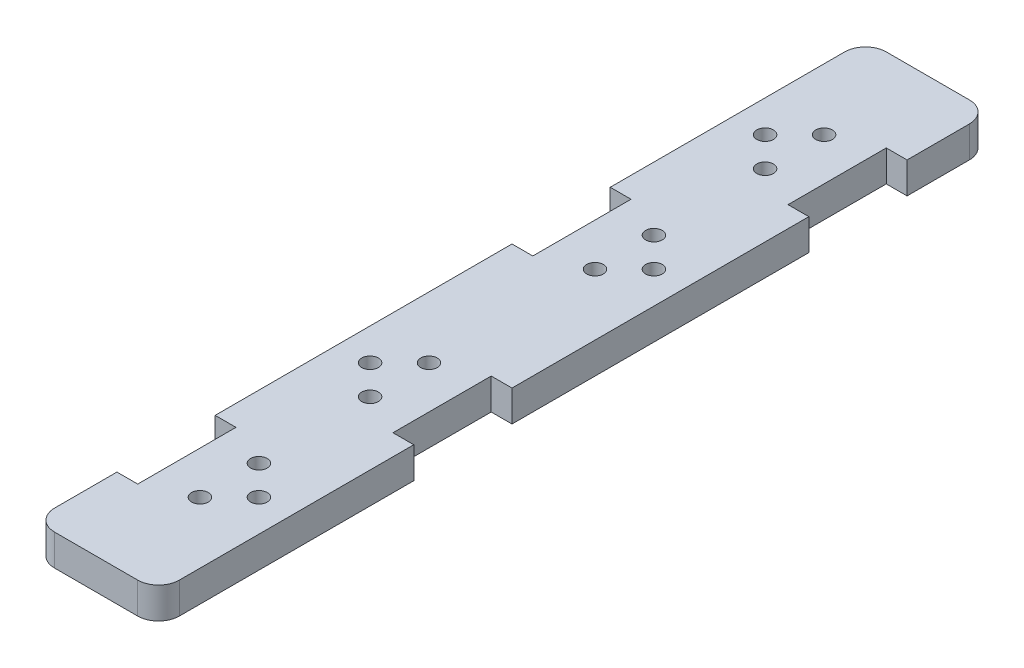
ISO-10303-21;
HEADER;
FILE_DESCRIPTION(('STEP AP214'),'2;1');
FILE_NAME('part.step','',(''),(''),'','','');
FILE_SCHEMA(('AUTOMOTIVE_DESIGN { 1 0 10303 214 1 1 1 1 }'));
ENDSEC;
DATA;
#1=APPLICATION_CONTEXT('core data for automotive mechanical design processes');
#2=APPLICATION_PROTOCOL_DEFINITION('international standard','automotive_design',2000,#1);
#3=PRODUCT_CONTEXT('',#1,'mechanical');
#4=PRODUCT('Part','Part','',(#3));
#5=PRODUCT_RELATED_PRODUCT_CATEGORY('part','',(#4));
#6=PRODUCT_DEFINITION_FORMATION('','',#4);
#7=PRODUCT_DEFINITION_CONTEXT('part definition',#1,'design');
#8=PRODUCT_DEFINITION('design','',#6,#7);
#9=PRODUCT_DEFINITION_SHAPE('','',#8);
#10=(LENGTH_UNIT() NAMED_UNIT(*) SI_UNIT(.MILLI.,.METRE.));
#11=(NAMED_UNIT(*) PLANE_ANGLE_UNIT() SI_UNIT($,.RADIAN.));
#12=(NAMED_UNIT(*) SI_UNIT($,.STERADIAN.) SOLID_ANGLE_UNIT());
#13=UNCERTAINTY_MEASURE_WITH_UNIT(LENGTH_MEASURE(1.E-05),#10,'distance_accuracy_value','');
#14=(GEOMETRIC_REPRESENTATION_CONTEXT(3) GLOBAL_UNCERTAINTY_ASSIGNED_CONTEXT((#13)) GLOBAL_UNIT_ASSIGNED_CONTEXT((#10,
#11,#12)) REPRESENTATION_CONTEXT('',''));
#15=CARTESIAN_POINT('',(0.,0.,0.));
#16=DIRECTION('',(0.,0.,1.));
#17=DIRECTION('',(1.,0.,0.));
#18=AXIS2_PLACEMENT_3D('',#15,#16,#17);
#19=CARTESIAN_POINT('',(38.1,9.525,-6.35000000000004));
#20=DIRECTION('',(-1.,0.,0.));
#21=DIRECTION('',(0.,0.,1.));
#22=AXIS2_PLACEMENT_3D('',#19,#20,#21);
#23=PLANE('',#22);
#24=DIRECTION('',(0.,0.,-1.));
#25=VECTOR('',#24,1.);
#26=CARTESIAN_POINT('',(38.1,9.525,-6.35000000000004));
#27=LINE('',#26,#25);
#28=CARTESIAN_POINT('',(38.1,9.525,-228.6));
#29=VERTEX_POINT('',#28);
#30=CARTESIAN_POINT('',(38.1,9.525,-247.65));
#31=VERTEX_POINT('',#30);
#32=EDGE_CURVE('E355',#29,#31,#27,.T.);
#33=ORIENTED_EDGE('',*,*,#32,.F.);
#34=DIRECTION('',(0.,1.,0.));
#35=VECTOR('',#34,1.);
#36=CARTESIAN_POINT('',(38.1,-0.000999999999999265,-228.6));
#37=LINE('',#36,#35);
#38=CARTESIAN_POINT('',(38.1,0.,-228.6));
#39=VERTEX_POINT('',#38);
#40=EDGE_CURVE('E304',#39,#29,#37,.T.);
#41=ORIENTED_EDGE('',*,*,#40,.F.);
#42=DIRECTION('',(0.,0.,-1.));
#43=VECTOR('',#42,1.);
#44=CARTESIAN_POINT('',(38.1,0.,-6.35000000000004));
#45=LINE('',#44,#43);
#46=CARTESIAN_POINT('',(38.1,0.,-247.65));
#47=VERTEX_POINT('',#46);
#48=EDGE_CURVE('E378',#39,#47,#45,.T.);
#49=ORIENTED_EDGE('',*,*,#48,.T.);
#50=DIRECTION('',(0.,-1.,0.));
#51=VECTOR('',#50,1.);
#52=CARTESIAN_POINT('',(38.1,9.525,-247.65));
#53=LINE('',#52,#51);
#54=EDGE_CURVE('E403',#31,#47,#53,.T.);
#55=ORIENTED_EDGE('',*,*,#54,.F.);
#56=EDGE_LOOP('',(#33,#41,#49,#55));
#57=FACE_BOUND('',#56,.T.);
#58=ADVANCED_FACE('F32',(#57),#23,.F.);
#59=CARTESIAN_POINT('',(38.1000000000013,0.,-107.95));
#60=VERTEX_POINT('',#59);
#61=CARTESIAN_POINT('',(38.1,0.,-198.6));
#62=VERTEX_POINT('',#61);
#63=EDGE_CURVE('E382',#60,#62,#45,.T.);
#64=ORIENTED_EDGE('',*,*,#63,.T.);
#65=DIRECTION('',(0.,1.,0.));
#66=VECTOR('',#65,1.);
#67=CARTESIAN_POINT('',(38.1,-0.000999999999999265,-198.6));
#68=LINE('',#67,#66);
#69=CARTESIAN_POINT('',(38.1,9.525,-198.6));
#70=VERTEX_POINT('',#69);
#71=EDGE_CURVE('E306',#62,#70,#68,.T.);
#72=ORIENTED_EDGE('',*,*,#71,.T.);
#73=CARTESIAN_POINT('',(38.1000000000013,9.525,-107.95));
#74=VERTEX_POINT('',#73);
#75=EDGE_CURVE('E360',#74,#70,#27,.T.);
#76=ORIENTED_EDGE('',*,*,#75,.F.);
#77=DIRECTION('',(0.,1.,0.));
#78=VECTOR('',#77,1.);
#79=CARTESIAN_POINT('',(38.1000000000013,-0.000999999999999265,-107.95));
#80=LINE('',#79,#78);
#81=EDGE_CURVE('E235',#60,#74,#80,.T.);
#82=ORIENTED_EDGE('',*,*,#81,.F.);
#83=EDGE_LOOP('',(#64,#72,#76,#82));
#84=FACE_BOUND('',#83,.T.);
#85=ADVANCED_FACE('F465',(#84),#23,.F.);
#86=CARTESIAN_POINT('',(0.,9.525,-6.35000000000004));
#87=DIRECTION('',(1.,0.,0.));
#88=DIRECTION('',(0.,0.,-1.));
#89=AXIS2_PLACEMENT_3D('',#86,#87,#88);
#90=PLANE('',#89);
#91=DIRECTION('',(0.,0.,1.));
#92=VECTOR('',#91,1.);
#93=CARTESIAN_POINT('',(0.,0.,-6.35000000000004));
#94=LINE('',#93,#92);
#95=CARTESIAN_POINT('',(0.,0.,-247.65));
#96=VERTEX_POINT('',#95);
#97=CARTESIAN_POINT('',(-3.6920551925212E-13,0.,-176.05));
#98=VERTEX_POINT('',#97);
#99=EDGE_CURVE('E351',#96,#98,#94,.T.);
#100=ORIENTED_EDGE('',*,*,#99,.T.);
#101=DIRECTION('',(0.,1.,0.));
#102=VECTOR('',#101,1.);
#103=CARTESIAN_POINT('',(-3.6920551925212E-13,-0.000999999999999265,-176.05));
#104=LINE('',#103,#102);
#105=CARTESIAN_POINT('',(-3.6920551925212E-13,9.525,-176.05));
#106=VERTEX_POINT('',#105);
#107=EDGE_CURVE('E266',#98,#106,#104,.T.);
#108=ORIENTED_EDGE('',*,*,#107,.T.);
#109=DIRECTION('',(0.,0.,1.));
#110=VECTOR('',#109,1.);
#111=CARTESIAN_POINT('',(0.,9.525,-6.35000000000004));
#112=LINE('',#111,#110);
#113=CARTESIAN_POINT('',(0.,9.525,-247.65));
#114=VERTEX_POINT('',#113);
#115=EDGE_CURVE('E367',#114,#106,#112,.T.);
#116=ORIENTED_EDGE('',*,*,#115,.F.);
#117=DIRECTION('',(0.,-1.,0.));
#118=VECTOR('',#117,1.);
#119=CARTESIAN_POINT('',(0.,9.525,-247.65));
#120=LINE('',#119,#118);
#121=EDGE_CURVE('E394',#114,#96,#120,.T.);
#122=ORIENTED_EDGE('',*,*,#121,.T.);
#123=EDGE_LOOP('',(#100,#108,#116,#122));
#124=FACE_BOUND('',#123,.T.);
#125=ADVANCED_FACE('F454',(#124),#90,.F.);
#126=CARTESIAN_POINT('',(-3.67037114907149E-13,9.525,-146.05));
#127=VERTEX_POINT('',#126);
#128=CARTESIAN_POINT('',(0.,9.525,-55.4));
#129=VERTEX_POINT('',#128);
#130=EDGE_CURVE('E371',#127,#129,#112,.T.);
#131=ORIENTED_EDGE('',*,*,#130,.F.);
#132=DIRECTION('',(0.,1.,0.));
#133=VECTOR('',#132,1.);
#134=CARTESIAN_POINT('',(-3.67037114907149E-13,-0.000999999999999265,-146.05));
#135=LINE('',#134,#133);
#136=CARTESIAN_POINT('',(0.,0.,-146.05));
#137=VERTEX_POINT('',#136);
#138=EDGE_CURVE('E265',#137,#127,#135,.T.);
#139=ORIENTED_EDGE('',*,*,#138,.F.);
#140=CARTESIAN_POINT('',(0.,0.,-55.4));
#141=VERTEX_POINT('',#140);
#142=EDGE_CURVE('E391',#137,#141,#94,.T.);
#143=ORIENTED_EDGE('',*,*,#142,.T.);
#144=DIRECTION('',(0.,1.,0.));
#145=VECTOR('',#144,1.);
#146=CARTESIAN_POINT('',(0.,-0.000999999999999265,-55.4));
#147=LINE('',#146,#145);
#148=EDGE_CURVE('E336',#141,#129,#147,.T.);
#149=ORIENTED_EDGE('',*,*,#148,.T.);
#150=EDGE_LOOP('',(#131,#139,#143,#149));
#151=FACE_BOUND('',#150,.T.);
#152=ADVANCED_FACE('F438',(#151),#90,.F.);
#153=CARTESIAN_POINT('',(6.35,9.525,-6.35));
#154=DIRECTION('',(0.,-1.,0.));
#155=DIRECTION('',(0.,0.,-1.));
#156=AXIS2_PLACEMENT_3D('',#153,#154,#155);
#157=CYLINDRICAL_SURFACE('',#156,6.35);
#158=CARTESIAN_POINT('',(6.35,0.,-6.35));
#159=DIRECTION('',(0.,1.,0.));
#160=DIRECTION('',(0.,0.,1.));
#161=AXIS2_PLACEMENT_3D('',#158,#159,#160);
#162=CIRCLE('',#161,6.35);
#163=CARTESIAN_POINT('',(0.,0.,-6.35000000000004));
#164=VERTEX_POINT('',#163);
#165=CARTESIAN_POINT('',(6.35000000000004,0.,0.));
#166=VERTEX_POINT('',#165);
#167=EDGE_CURVE('E346',#164,#166,#162,.T.);
#168=ORIENTED_EDGE('',*,*,#167,.T.);
#169=DIRECTION('',(0.,-1.,0.));
#170=VECTOR('',#169,1.);
#171=CARTESIAN_POINT('',(6.35000000000004,9.525,0.));
#172=LINE('',#171,#170);
#173=CARTESIAN_POINT('',(6.35000000000004,9.525,0.));
#174=VERTEX_POINT('',#173);
#175=EDGE_CURVE('E11',#174,#166,#172,.T.);
#176=ORIENTED_EDGE('',*,*,#175,.F.);
#177=CARTESIAN_POINT('',(6.35,9.525,-6.35));
#178=DIRECTION('',(0.,1.,0.));
#179=DIRECTION('',(0.,0.,1.));
#180=AXIS2_PLACEMENT_3D('',#177,#178,#179);
#181=CIRCLE('',#180,6.35);
#182=CARTESIAN_POINT('',(0.,9.525,-6.35000000000004));
#183=VERTEX_POINT('',#182);
#184=EDGE_CURVE('E347',#183,#174,#181,.T.);
#185=ORIENTED_EDGE('',*,*,#184,.F.);
#186=DIRECTION('',(0.,-1.,0.));
#187=VECTOR('',#186,1.);
#188=CARTESIAN_POINT('',(0.,9.525,-6.35000000000004));
#189=LINE('',#188,#187);
#190=EDGE_CURVE('E370',#183,#164,#189,.T.);
#191=ORIENTED_EDGE('',*,*,#190,.T.);
#192=EDGE_LOOP('',(#168,#176,#185,#191));
#193=FACE_BOUND('',#192,.T.);
#194=ADVANCED_FACE('F34',(#193),#157,.T.);
#195=CARTESIAN_POINT('',(6.35000000000004,9.525,0.));
#196=DIRECTION('',(0.,0.,-1.));
#197=DIRECTION('',(-1.,0.,0.));
#198=AXIS2_PLACEMENT_3D('',#195,#196,#197);
#199=PLANE('',#198);
#200=DIRECTION('',(1.,0.,0.));
#201=VECTOR('',#200,1.);
#202=CARTESIAN_POINT('',(6.35000000000004,0.,0.));
#203=LINE('',#202,#201);
#204=CARTESIAN_POINT('',(31.75,0.,0.));
#205=VERTEX_POINT('',#204);
#206=EDGE_CURVE('E374',#166,#205,#203,.T.);
#207=ORIENTED_EDGE('',*,*,#206,.T.);
#208=DIRECTION('',(0.,-1.,0.));
#209=VECTOR('',#208,1.);
#210=CARTESIAN_POINT('',(31.75,9.525,0.));
#211=LINE('',#210,#209);
#212=CARTESIAN_POINT('',(31.75,9.525,0.));
#213=VERTEX_POINT('',#212);
#214=EDGE_CURVE('E40',#213,#205,#211,.T.);
#215=ORIENTED_EDGE('',*,*,#214,.F.);
#216=DIRECTION('',(1.,0.,0.));
#217=VECTOR('',#216,1.);
#218=CARTESIAN_POINT('',(6.35000000000004,9.525,0.));
#219=LINE('',#218,#217);
#220=EDGE_CURVE('E350',#174,#213,#219,.T.);
#221=ORIENTED_EDGE('',*,*,#220,.F.);
#222=ORIENTED_EDGE('',*,*,#175,.T.);
#223=EDGE_LOOP('',(#207,#215,#221,#222));
#224=FACE_BOUND('',#223,.T.);
#225=ADVANCED_FACE('F426',(#224),#199,.F.);
#226=CARTESIAN_POINT('',(31.75,9.525,-6.35));
#227=DIRECTION('',(0.,-1.,0.));
#228=DIRECTION('',(0.,0.,-1.));
#229=AXIS2_PLACEMENT_3D('',#226,#227,#228);
#230=CYLINDRICAL_SURFACE('',#229,6.35);
#231=CARTESIAN_POINT('',(31.75,0.,-6.35));
#232=DIRECTION('',(0.,1.,0.));
#233=DIRECTION('',(0.,0.,1.));
#234=AXIS2_PLACEMENT_3D('',#231,#232,#233);
#235=CIRCLE('',#234,6.35);
#236=CARTESIAN_POINT('',(38.1,0.,-6.35000000000004));
#237=VERTEX_POINT('',#236);
#238=EDGE_CURVE('E376',#205,#237,#235,.T.);
#239=ORIENTED_EDGE('',*,*,#238,.T.);
#240=DIRECTION('',(0.,-1.,0.));
#241=VECTOR('',#240,1.);
#242=CARTESIAN_POINT('',(38.1,9.525,-6.35000000000004));
#243=LINE('',#242,#241);
#244=CARTESIAN_POINT('',(38.1,9.525,-6.35000000000004));
#245=VERTEX_POINT('',#244);
#246=EDGE_CURVE('E406',#245,#237,#243,.T.);
#247=ORIENTED_EDGE('',*,*,#246,.F.);
#248=CARTESIAN_POINT('',(31.75,9.525,-6.35));
#249=DIRECTION('',(0.,1.,0.));
#250=DIRECTION('',(0.,0.,1.));
#251=AXIS2_PLACEMENT_3D('',#248,#249,#250);
#252=CIRCLE('',#251,6.35);
#253=EDGE_CURVE('E353',#213,#245,#252,.T.);
#254=ORIENTED_EDGE('',*,*,#253,.F.);
#255=ORIENTED_EDGE('',*,*,#214,.T.);
#256=EDGE_LOOP('',(#239,#247,#254,#255));
#257=FACE_BOUND('',#256,.T.);
#258=ADVANCED_FACE('F413',(#257),#230,.T.);
#259=CARTESIAN_POINT('',(38.1,0.,-77.95));
#260=VERTEX_POINT('',#259);
#261=EDGE_CURVE('E379',#237,#260,#45,.T.);
#262=ORIENTED_EDGE('',*,*,#261,.T.);
#263=DIRECTION('',(0.,1.,0.));
#264=VECTOR('',#263,1.);
#265=CARTESIAN_POINT('',(38.1000000000013,-0.000999999999999265,-77.9500000000001));
#266=LINE('',#265,#264);
#267=CARTESIAN_POINT('',(38.1000000000013,9.525,-77.9500000000001));
#268=VERTEX_POINT('',#267);
#269=EDGE_CURVE('E203',#260,#268,#266,.T.);
#270=ORIENTED_EDGE('',*,*,#269,.T.);
#271=EDGE_CURVE('E356',#245,#268,#27,.T.);
#272=ORIENTED_EDGE('',*,*,#271,.F.);
#273=ORIENTED_EDGE('',*,*,#246,.T.);
#274=EDGE_LOOP('',(#262,#270,#272,#273));
#275=FACE_BOUND('',#274,.T.);
#276=ADVANCED_FACE('F418',(#275),#23,.F.);
#277=CARTESIAN_POINT('',(31.75,9.525,-247.65));
#278=DIRECTION('',(0.,-1.,0.));
#279=DIRECTION('',(0.,0.,-1.));
#280=AXIS2_PLACEMENT_3D('',#277,#278,#279);
#281=CYLINDRICAL_SURFACE('',#280,6.35);
#282=CARTESIAN_POINT('',(31.75,0.,-247.65));
#283=DIRECTION('',(0.,1.,0.));
#284=DIRECTION('',(0.,0.,1.));
#285=AXIS2_PLACEMENT_3D('',#282,#283,#284);
#286=CIRCLE('',#285,6.35);
#287=CARTESIAN_POINT('',(31.75,0.,-254.));
#288=VERTEX_POINT('',#287);
#289=EDGE_CURVE('E381',#47,#288,#286,.T.);
#290=ORIENTED_EDGE('',*,*,#289,.T.);
#291=DIRECTION('',(0.,-1.,0.));
#292=VECTOR('',#291,1.);
#293=CARTESIAN_POINT('',(31.75,9.525,-254.));
#294=LINE('',#293,#292);
#295=CARTESIAN_POINT('',(31.75,9.525,-254.));
#296=VERTEX_POINT('',#295);
#297=EDGE_CURVE('E400',#296,#288,#294,.T.);
#298=ORIENTED_EDGE('',*,*,#297,.F.);
#299=CARTESIAN_POINT('',(31.75,9.525,-247.65));
#300=DIRECTION('',(0.,1.,0.));
#301=DIRECTION('',(0.,0.,1.));
#302=AXIS2_PLACEMENT_3D('',#299,#300,#301);
#303=CIRCLE('',#302,6.35);
#304=EDGE_CURVE('E359',#31,#296,#303,.T.);
#305=ORIENTED_EDGE('',*,*,#304,.F.);
#306=ORIENTED_EDGE('',*,*,#54,.T.);
#307=EDGE_LOOP('',(#290,#298,#305,#306));
#308=FACE_BOUND('',#307,.T.);
#309=ADVANCED_FACE('F479',(#308),#281,.T.);
#310=CARTESIAN_POINT('',(6.35000000000004,9.525,-254.));
#311=DIRECTION('',(0.,0.,1.));
#312=DIRECTION('',(1.,0.,0.));
#313=AXIS2_PLACEMENT_3D('',#310,#311,#312);
#314=PLANE('',#313);
#315=DIRECTION('',(-1.,0.,0.));
#316=VECTOR('',#315,1.);
#317=CARTESIAN_POINT('',(6.35000000000004,0.,-254.));
#318=LINE('',#317,#316);
#319=CARTESIAN_POINT('',(6.35000000000004,0.,-254.));
#320=VERTEX_POINT('',#319);
#321=EDGE_CURVE('E384',#288,#320,#318,.T.);
#322=ORIENTED_EDGE('',*,*,#321,.T.);
#323=DIRECTION('',(0.,-1.,0.));
#324=VECTOR('',#323,1.);
#325=CARTESIAN_POINT('',(6.35000000000004,9.525,-254.));
#326=LINE('',#325,#324);
#327=CARTESIAN_POINT('',(6.35000000000004,9.525,-254.));
#328=VERTEX_POINT('',#327);
#329=EDGE_CURVE('E397',#328,#320,#326,.T.);
#330=ORIENTED_EDGE('',*,*,#329,.F.);
#331=DIRECTION('',(-1.,0.,0.));
#332=VECTOR('',#331,1.);
#333=CARTESIAN_POINT('',(6.35000000000004,9.525,-254.));
#334=LINE('',#333,#332);
#335=EDGE_CURVE('E362',#296,#328,#334,.T.);
#336=ORIENTED_EDGE('',*,*,#335,.F.);
#337=ORIENTED_EDGE('',*,*,#297,.T.);
#338=EDGE_LOOP('',(#322,#330,#336,#337));
#339=FACE_BOUND('',#338,.T.);
#340=ADVANCED_FACE('F460',(#339),#314,.F.);
#341=CARTESIAN_POINT('',(6.35,9.525,-247.65));
#342=DIRECTION('',(0.,-1.,0.));
#343=DIRECTION('',(0.,0.,-1.));
#344=AXIS2_PLACEMENT_3D('',#341,#342,#343);
#345=CYLINDRICAL_SURFACE('',#344,6.35);
#346=CARTESIAN_POINT('',(6.35,0.,-247.65));
#347=DIRECTION('',(0.,1.,0.));
#348=DIRECTION('',(0.,0.,1.));
#349=AXIS2_PLACEMENT_3D('',#346,#347,#348);
#350=CIRCLE('',#349,6.35);
#351=EDGE_CURVE('E386',#320,#96,#350,.T.);
#352=ORIENTED_EDGE('',*,*,#351,.T.);
#353=ORIENTED_EDGE('',*,*,#121,.F.);
#354=CARTESIAN_POINT('',(6.35,9.525,-247.65));
#355=DIRECTION('',(0.,1.,0.));
#356=DIRECTION('',(0.,0.,1.));
#357=AXIS2_PLACEMENT_3D('',#354,#355,#356);
#358=CIRCLE('',#357,6.35);
#359=EDGE_CURVE('E364',#328,#114,#358,.T.);
#360=ORIENTED_EDGE('',*,*,#359,.F.);
#361=ORIENTED_EDGE('',*,*,#329,.T.);
#362=EDGE_LOOP('',(#352,#353,#360,#361));
#363=FACE_BOUND('',#362,.T.);
#364=ADVANCED_FACE('F452',(#363),#345,.T.);
#365=CARTESIAN_POINT('',(0.,9.525,-25.4));
#366=VERTEX_POINT('',#365);
#367=EDGE_CURVE('E366',#366,#183,#112,.T.);
#368=ORIENTED_EDGE('',*,*,#367,.F.);
#369=DIRECTION('',(0.,1.,0.));
#370=VECTOR('',#369,1.);
#371=CARTESIAN_POINT('',(0.,-0.000999999999999265,-25.4));
#372=LINE('',#371,#370);
#373=CARTESIAN_POINT('',(0.,0.,-25.4));
#374=VERTEX_POINT('',#373);
#375=EDGE_CURVE('E335',#374,#366,#372,.T.);
#376=ORIENTED_EDGE('',*,*,#375,.F.);
#377=EDGE_CURVE('E388',#374,#164,#94,.T.);
#378=ORIENTED_EDGE('',*,*,#377,.T.);
#379=ORIENTED_EDGE('',*,*,#190,.F.);
#380=EDGE_LOOP('',(#368,#376,#378,#379));
#381=FACE_BOUND('',#380,.T.);
#382=ADVANCED_FACE('F450',(#381),#90,.F.);
#383=CARTESIAN_POINT('',(6.35,9.525,-6.35));
#384=DIRECTION('',(0.,1.,0.));
#385=DIRECTION('',(0.,0.,1.));
#386=AXIS2_PLACEMENT_3D('',#383,#384,#385);
#387=PLANE('',#386);
#388=DIRECTION('',(-1.,0.,0.));
#389=VECTOR('',#388,1.);
#390=CARTESIAN_POINT('',(-3.6920551925212E-13,9.525,-176.05));
#391=LINE('',#390,#389);
#392=CARTESIAN_POINT('',(6.34999999999963,9.525,-176.05));
#393=VERTEX_POINT('',#392);
#394=EDGE_CURVE('E263',#393,#106,#391,.T.);
#395=ORIENTED_EDGE('',*,*,#394,.F.);
#396=DIRECTION('',(0.,0.,-1.));
#397=VECTOR('',#396,1.);
#398=CARTESIAN_POINT('',(6.34999999999963,9.525,-176.05));
#399=LINE('',#398,#397);
#400=CARTESIAN_POINT('',(6.34999999999963,9.525,-146.05));
#401=VERTEX_POINT('',#400);
#402=EDGE_CURVE('E260',#401,#393,#399,.T.);
#403=ORIENTED_EDGE('',*,*,#402,.F.);
#404=DIRECTION('',(1.,0.,0.));
#405=VECTOR('',#404,1.);
#406=CARTESIAN_POINT('',(-3.67037114907149E-13,9.525,-146.05));
#407=LINE('',#406,#405);
#408=EDGE_CURVE('E257',#127,#401,#407,.T.);
#409=ORIENTED_EDGE('',*,*,#408,.F.);
#410=ORIENTED_EDGE('',*,*,#130,.T.);
#411=DIRECTION('',(-1.,0.,0.));
#412=VECTOR('',#411,1.);
#413=CARTESIAN_POINT('',(0.,9.525,-55.4));
#414=LINE('',#413,#412);
#415=CARTESIAN_POINT('',(6.35000000000005,9.525,-55.4));
#416=VERTEX_POINT('',#415);
#417=EDGE_CURVE('E333',#416,#129,#414,.T.);
#418=ORIENTED_EDGE('',*,*,#417,.F.);
#419=DIRECTION('',(0.,0.,-1.));
#420=VECTOR('',#419,1.);
#421=CARTESIAN_POINT('',(6.35000000000005,9.525,-55.4));
#422=LINE('',#421,#420);
#423=CARTESIAN_POINT('',(6.35000000000005,9.525,-25.4));
#424=VERTEX_POINT('',#423);
#425=EDGE_CURVE('E330',#424,#416,#422,.T.);
#426=ORIENTED_EDGE('',*,*,#425,.F.);
#427=DIRECTION('',(1.,0.,0.));
#428=VECTOR('',#427,1.);
#429=CARTESIAN_POINT('',(0.,9.525,-25.4));
#430=LINE('',#429,#428);
#431=EDGE_CURVE('E327',#366,#424,#430,.T.);
#432=ORIENTED_EDGE('',*,*,#431,.F.);
#433=ORIENTED_EDGE('',*,*,#367,.T.);
#434=ORIENTED_EDGE('',*,*,#184,.T.);
#435=ORIENTED_EDGE('',*,*,#220,.T.);
#436=ORIENTED_EDGE('',*,*,#253,.T.);
#437=ORIENTED_EDGE('',*,*,#271,.T.);
#438=DIRECTION('',(1.,0.,0.));
#439=VECTOR('',#438,1.);
#440=CARTESIAN_POINT('',(31.7500000000013,9.525,-77.95));
#441=LINE('',#440,#439);
#442=CARTESIAN_POINT('',(31.7500000000013,9.525,-77.95));
#443=VERTEX_POINT('',#442);
#444=EDGE_CURVE('E230',#443,#268,#441,.T.);
#445=ORIENTED_EDGE('',*,*,#444,.F.);
#446=DIRECTION('',(0.,0.,1.));
#447=VECTOR('',#446,1.);
#448=CARTESIAN_POINT('',(31.7500000000013,9.525,-107.95));
#449=LINE('',#448,#447);
#450=CARTESIAN_POINT('',(31.7500000000013,9.525,-107.95));
#451=VERTEX_POINT('',#450);
#452=EDGE_CURVE('E200',#451,#443,#449,.T.);
#453=ORIENTED_EDGE('',*,*,#452,.F.);
#454=DIRECTION('',(-1.,0.,0.));
#455=VECTOR('',#454,1.);
#456=CARTESIAN_POINT('',(31.7500000000013,9.525,-107.95));
#457=LINE('',#456,#455);
#458=EDGE_CURVE('E204',#74,#451,#457,.T.);
#459=ORIENTED_EDGE('',*,*,#458,.F.);
#460=ORIENTED_EDGE('',*,*,#75,.T.);
#461=DIRECTION('',(1.,0.,0.));
#462=VECTOR('',#461,1.);
#463=CARTESIAN_POINT('',(31.75,9.525,-198.6));
#464=LINE('',#463,#462);
#465=CARTESIAN_POINT('',(31.75,9.525,-198.6));
#466=VERTEX_POINT('',#465);
#467=EDGE_CURVE('E296',#466,#70,#464,.T.);
#468=ORIENTED_EDGE('',*,*,#467,.F.);
#469=DIRECTION('',(0.,0.,1.));
#470=VECTOR('',#469,1.);
#471=CARTESIAN_POINT('',(31.75,9.525,-228.6));
#472=LINE('',#471,#470);
#473=CARTESIAN_POINT('',(31.75,9.525,-228.6));
#474=VERTEX_POINT('',#473);
#475=EDGE_CURVE('E293',#474,#466,#472,.T.);
#476=ORIENTED_EDGE('',*,*,#475,.F.);
#477=DIRECTION('',(-1.,0.,0.));
#478=VECTOR('',#477,1.);
#479=CARTESIAN_POINT('',(31.75,9.525,-228.6));
#480=LINE('',#479,#478);
#481=EDGE_CURVE('E298',#29,#474,#480,.T.);
#482=ORIENTED_EDGE('',*,*,#481,.F.);
#483=ORIENTED_EDGE('',*,*,#32,.T.);
#484=ORIENTED_EDGE('',*,*,#304,.T.);
#485=ORIENTED_EDGE('',*,*,#335,.T.);
#486=ORIENTED_EDGE('',*,*,#359,.T.);
#487=ORIENTED_EDGE('',*,*,#115,.T.);
#488=EDGE_LOOP('',(#395,#403,#409,#410,#418,#426,#432,#433,#434,#435,#436,#437,#445,#453,#459,
#460,#468,#476,#482,#483,#484,#485,#486,#487));
#489=FACE_BOUND('',#488,.T.);
#490=CARTESIAN_POINT('',(28.3499991799996,9.525,-161.05));
#491=DIRECTION('',(0.,1.,0.));
#492=DIRECTION('',(0.,0.,1.));
#493=AXIS2_PLACEMENT_3D('',#490,#491,#492);
#494=CIRCLE('',#493,2.54);
#495=CARTESIAN_POINT('',(28.3499991799996,9.525,-158.51));
#496=VERTEX_POINT('',#495);
#497=EDGE_CURVE('E245',#496,#496,#494,.T.);
#498=ORIENTED_EDGE('',*,*,#497,.F.);
#499=EDGE_LOOP('',(#498));
#500=FACE_BOUND('',#499,.T.);
#501=CARTESIAN_POINT('',(19.3499993999996,9.525,-170.04999978));
#502=DIRECTION('',(0.,1.,0.));
#503=DIRECTION('',(0.,0.,1.));
#504=AXIS2_PLACEMENT_3D('',#501,#502,#503);
#505=CIRCLE('',#504,2.54);
#506=CARTESIAN_POINT('',(19.3499993999996,9.525,-167.50999978));
#507=VERTEX_POINT('',#506);
#508=EDGE_CURVE('E238',#507,#507,#505,.T.);
#509=ORIENTED_EDGE('',*,*,#508,.F.);
#510=EDGE_LOOP('',(#509));
#511=FACE_BOUND('',#510,.T.);
#512=CARTESIAN_POINT('',(19.3499993999996,9.525,-152.05000022));
#513=DIRECTION('',(0.,1.,0.));
#514=DIRECTION('',(0.,0.,-1.));
#515=AXIS2_PLACEMENT_3D('',#512,#513,#514);
#516=CIRCLE('',#515,2.54);
#517=CARTESIAN_POINT('',(19.3499993999996,9.525,-154.59000022));
#518=VERTEX_POINT('',#517);
#519=EDGE_CURVE('E246',#518,#518,#516,.T.);
#520=ORIENTED_EDGE('',*,*,#519,.F.);
#521=EDGE_LOOP('',(#520));
#522=FACE_BOUND('',#521,.T.);
#523=CARTESIAN_POINT('',(28.3499991800001,9.525,-40.4));
#524=DIRECTION('',(0.,1.,0.));
#525=DIRECTION('',(0.,0.,1.));
#526=AXIS2_PLACEMENT_3D('',#523,#524,#525);
#527=CIRCLE('',#526,2.54);
#528=CARTESIAN_POINT('',(28.3499991800001,9.525,-37.86));
#529=VERTEX_POINT('',#528);
#530=EDGE_CURVE('E312',#529,#529,#527,.T.);
#531=ORIENTED_EDGE('',*,*,#530,.F.);
#532=EDGE_LOOP('',(#531));
#533=FACE_BOUND('',#532,.T.);
#534=CARTESIAN_POINT('',(19.3499994,9.525,-49.39999978));
#535=DIRECTION('',(0.,1.,0.));
#536=DIRECTION('',(0.,0.,1.));
#537=AXIS2_PLACEMENT_3D('',#534,#535,#536);
#538=CIRCLE('',#537,2.54);
#539=CARTESIAN_POINT('',(19.3499994,9.525,-46.85999978));
#540=VERTEX_POINT('',#539);
#541=EDGE_CURVE('E288',#540,#540,#538,.T.);
#542=ORIENTED_EDGE('',*,*,#541,.F.);
#543=EDGE_LOOP('',(#542));
#544=FACE_BOUND('',#543,.T.);
#545=CARTESIAN_POINT('',(19.3499994,9.525,-31.40000022));
#546=DIRECTION('',(0.,1.,0.));
#547=DIRECTION('',(0.,0.,-1.));
#548=AXIS2_PLACEMENT_3D('',#545,#546,#547);
#549=CIRCLE('',#548,2.54);
#550=CARTESIAN_POINT('',(19.3499994,9.525,-33.94000022));
#551=VERTEX_POINT('',#550);
#552=EDGE_CURVE('E281',#551,#551,#549,.T.);
#553=ORIENTED_EDGE('',*,*,#552,.F.);
#554=EDGE_LOOP('',(#553));
#555=FACE_BOUND('',#554,.T.);
#556=CARTESIAN_POINT('',(18.7500006000013,9.525,-83.95000022));
#557=DIRECTION('',(0.,1.,0.));
#558=DIRECTION('',(0.,0.,-1.));
#559=AXIS2_PLACEMENT_3D('',#556,#557,#558);
#560=CIRCLE('',#559,2.54000000000001);
#561=CARTESIAN_POINT('',(18.7500006000013,9.525,-86.49000022));
#562=VERTEX_POINT('',#561);
#563=EDGE_CURVE('E878',#562,#562,#560,.T.);
#564=ORIENTED_EDGE('',*,*,#563,.F.);
#565=EDGE_LOOP('',(#564));
#566=FACE_BOUND('',#565,.T.);
#567=CARTESIAN_POINT('',(18.7500006000013,9.525,-101.94999978));
#568=DIRECTION('',(0.,1.,0.));
#569=DIRECTION('',(0.,0.,1.));
#570=AXIS2_PLACEMENT_3D('',#567,#568,#569);
#571=CIRCLE('',#570,2.54000000000001);
#572=CARTESIAN_POINT('',(18.7500006000013,9.525,-99.40999978));
#573=VERTEX_POINT('',#572);
#574=EDGE_CURVE('E877',#573,#573,#571,.T.);
#575=ORIENTED_EDGE('',*,*,#574,.F.);
#576=EDGE_LOOP('',(#575));
#577=FACE_BOUND('',#576,.T.);
#578=CARTESIAN_POINT('',(9.75000082000127,9.525,-92.95));
#579=DIRECTION('',(0.,1.,0.));
#580=DIRECTION('',(0.,0.,1.));
#581=AXIS2_PLACEMENT_3D('',#578,#579,#580);
#582=CIRCLE('',#581,2.54);
#583=CARTESIAN_POINT('',(9.75000082000127,9.525,-90.41));
#584=VERTEX_POINT('',#583);
#585=EDGE_CURVE('E223',#584,#584,#582,.T.);
#586=ORIENTED_EDGE('',*,*,#585,.F.);
#587=EDGE_LOOP('',(#586));
#588=FACE_BOUND('',#587,.T.);
#589=CARTESIAN_POINT('',(18.7500006,9.525,-204.60000022));
#590=DIRECTION('',(0.,1.,0.));
#591=DIRECTION('',(0.,0.,-1.));
#592=AXIS2_PLACEMENT_3D('',#589,#590,#591);
#593=CIRCLE('',#592,2.54000000000001);
#594=CARTESIAN_POINT('',(18.7500006,9.525,-207.14000022));
#595=VERTEX_POINT('',#594);
#596=EDGE_CURVE('E213',#595,#595,#593,.T.);
#597=ORIENTED_EDGE('',*,*,#596,.F.);
#598=EDGE_LOOP('',(#597));
#599=FACE_BOUND('',#598,.T.);
#600=CARTESIAN_POINT('',(18.7500006,9.525,-222.59999978));
#601=DIRECTION('',(0.,1.,0.));
#602=DIRECTION('',(0.,0.,1.));
#603=AXIS2_PLACEMENT_3D('',#600,#601,#602);
#604=CIRCLE('',#603,2.54000000000001);
#605=CARTESIAN_POINT('',(18.7500006,9.525,-220.05999978));
#606=VERTEX_POINT('',#605);
#607=EDGE_CURVE('E864',#606,#606,#604,.T.);
#608=ORIENTED_EDGE('',*,*,#607,.F.);
#609=EDGE_LOOP('',(#608));
#610=FACE_BOUND('',#609,.T.);
#611=CARTESIAN_POINT('',(9.75000082000001,9.525,-213.6));
#612=DIRECTION('',(0.,1.,0.));
#613=DIRECTION('',(0.,0.,1.));
#614=AXIS2_PLACEMENT_3D('',#611,#612,#613);
#615=CIRCLE('',#614,2.54);
#616=CARTESIAN_POINT('',(9.75000082000001,9.525,-211.06));
#617=VERTEX_POINT('',#616);
#618=EDGE_CURVE('E858',#617,#617,#615,.T.);
#619=ORIENTED_EDGE('',*,*,#618,.F.);
#620=EDGE_LOOP('',(#619));
#621=FACE_BOUND('',#620,.T.);
#622=ADVANCED_FACE('F422',(#489,#500,#511,#522,#533,#544,#555,#566,#577,#588,#599,#610,#621),
#387,.T.);
#623=CARTESIAN_POINT('',(6.35,0.,-6.35));
#624=DIRECTION('',(0.,1.,0.));
#625=DIRECTION('',(0.,0.,1.));
#626=AXIS2_PLACEMENT_3D('',#623,#624,#625);
#627=PLANE('',#626);
#628=CARTESIAN_POINT('',(28.3499991799996,0.,-161.05));
#629=DIRECTION('',(0.,1.,0.));
#630=DIRECTION('',(0.,0.,1.));
#631=AXIS2_PLACEMENT_3D('',#628,#629,#630);
#632=CIRCLE('',#631,2.54);
#633=CARTESIAN_POINT('',(28.3499991799996,0.,-158.51));
#634=VERTEX_POINT('',#633);
#635=EDGE_CURVE('E254',#634,#634,#632,.F.);
#636=ORIENTED_EDGE('',*,*,#635,.F.);
#637=EDGE_LOOP('',(#636));
#638=FACE_BOUND('',#637,.T.);
#639=CARTESIAN_POINT('',(19.3499993999996,0.,-170.04999978));
#640=DIRECTION('',(0.,1.,0.));
#641=DIRECTION('',(0.,0.,1.));
#642=AXIS2_PLACEMENT_3D('',#639,#640,#641);
#643=CIRCLE('',#642,2.54);
#644=CARTESIAN_POINT('',(19.3499993999996,0.,-167.50999978));
#645=VERTEX_POINT('',#644);
#646=EDGE_CURVE('E241',#645,#645,#643,.F.);
#647=ORIENTED_EDGE('',*,*,#646,.F.);
#648=EDGE_LOOP('',(#647));
#649=FACE_BOUND('',#648,.T.);
#650=CARTESIAN_POINT('',(19.3499993999996,0.,-152.05000022));
#651=DIRECTION('',(0.,1.,0.));
#652=DIRECTION('',(0.,0.,1.));
#653=AXIS2_PLACEMENT_3D('',#650,#651,#652);
#654=CIRCLE('',#653,2.54);
#655=CARTESIAN_POINT('',(19.3499993999996,0.,-149.51000022));
#656=VERTEX_POINT('',#655);
#657=EDGE_CURVE('E242',#656,#656,#654,.F.);
#658=ORIENTED_EDGE('',*,*,#657,.F.);
#659=EDGE_LOOP('',(#658));
#660=FACE_BOUND('',#659,.T.);
#661=CARTESIAN_POINT('',(28.3499991800001,0.,-40.4));
#662=DIRECTION('',(0.,1.,0.));
#663=DIRECTION('',(0.,0.,1.));
#664=AXIS2_PLACEMENT_3D('',#661,#662,#663);
#665=CIRCLE('',#664,2.54);
#666=CARTESIAN_POINT('',(28.3499991800001,0.,-37.86));
#667=VERTEX_POINT('',#666);
#668=EDGE_CURVE('E315',#667,#667,#665,.F.);
#669=ORIENTED_EDGE('',*,*,#668,.F.);
#670=EDGE_LOOP('',(#669));
#671=FACE_BOUND('',#670,.T.);
#672=CARTESIAN_POINT('',(19.3499994,0.,-49.39999978));
#673=DIRECTION('',(0.,1.,0.));
#674=DIRECTION('',(0.,0.,1.));
#675=AXIS2_PLACEMENT_3D('',#672,#673,#674);
#676=CIRCLE('',#675,2.54);
#677=CARTESIAN_POINT('',(19.3499994,0.,-46.85999978));
#678=VERTEX_POINT('',#677);
#679=EDGE_CURVE('E316',#678,#678,#676,.F.);
#680=ORIENTED_EDGE('',*,*,#679,.F.);
#681=EDGE_LOOP('',(#680));
#682=FACE_BOUND('',#681,.T.);
#683=CARTESIAN_POINT('',(19.3499994,0.,-31.40000022));
#684=DIRECTION('',(0.,1.,0.));
#685=DIRECTION('',(0.,0.,1.));
#686=AXIS2_PLACEMENT_3D('',#683,#684,#685);
#687=CIRCLE('',#686,2.54);
#688=CARTESIAN_POINT('',(19.3499994,0.,-28.86000022));
#689=VERTEX_POINT('',#688);
#690=EDGE_CURVE('E284',#689,#689,#687,.F.);
#691=ORIENTED_EDGE('',*,*,#690,.F.);
#692=EDGE_LOOP('',(#691));
#693=FACE_BOUND('',#692,.T.);
#694=CARTESIAN_POINT('',(18.7500006000013,0.,-83.95000022));
#695=DIRECTION('',(0.,1.,0.));
#696=DIRECTION('',(0.,0.,1.));
#697=AXIS2_PLACEMENT_3D('',#694,#695,#696);
#698=CIRCLE('',#697,2.54000000000001);
#699=CARTESIAN_POINT('',(18.7500006000013,0.,-81.41000022));
#700=VERTEX_POINT('',#699);
#701=EDGE_CURVE('E841',#700,#700,#698,.F.);
#702=ORIENTED_EDGE('',*,*,#701,.F.);
#703=EDGE_LOOP('',(#702));
#704=FACE_BOUND('',#703,.T.);
#705=CARTESIAN_POINT('',(18.7500006000013,0.,-101.94999978));
#706=DIRECTION('',(0.,1.,0.));
#707=DIRECTION('',(0.,0.,1.));
#708=AXIS2_PLACEMENT_3D('',#705,#706,#707);
#709=CIRCLE('',#708,2.54000000000001);
#710=CARTESIAN_POINT('',(18.7500006000013,0.,-99.40999978));
#711=VERTEX_POINT('',#710);
#712=EDGE_CURVE('E845',#711,#711,#709,.F.);
#713=ORIENTED_EDGE('',*,*,#712,.F.);
#714=EDGE_LOOP('',(#713));
#715=FACE_BOUND('',#714,.T.);
#716=CARTESIAN_POINT('',(9.75000082000127,0.,-92.95));
#717=DIRECTION('',(0.,1.,0.));
#718=DIRECTION('',(0.,0.,1.));
#719=AXIS2_PLACEMENT_3D('',#716,#717,#718);
#720=CIRCLE('',#719,2.54);
#721=CARTESIAN_POINT('',(9.75000082000127,0.,-90.41));
#722=VERTEX_POINT('',#721);
#723=EDGE_CURVE('E219',#722,#722,#720,.F.);
#724=ORIENTED_EDGE('',*,*,#723,.F.);
#725=EDGE_LOOP('',(#724));
#726=FACE_BOUND('',#725,.T.);
#727=CARTESIAN_POINT('',(18.7500006,0.,-204.60000022));
#728=DIRECTION('',(0.,1.,0.));
#729=DIRECTION('',(0.,0.,1.));
#730=AXIS2_PLACEMENT_3D('',#727,#728,#729);
#731=CIRCLE('',#730,2.54000000000001);
#732=CARTESIAN_POINT('',(18.7500006,0.,-202.06000022));
#733=VERTEX_POINT('',#732);
#734=EDGE_CURVE('E226',#733,#733,#731,.F.);
#735=ORIENTED_EDGE('',*,*,#734,.F.);
#736=EDGE_LOOP('',(#735));
#737=FACE_BOUND('',#736,.T.);
#738=CARTESIAN_POINT('',(18.7500006,0.,-222.59999978));
#739=DIRECTION('',(0.,1.,0.));
#740=DIRECTION('',(0.,0.,1.));
#741=AXIS2_PLACEMENT_3D('',#738,#739,#740);
#742=CIRCLE('',#741,2.54000000000001);
#743=CARTESIAN_POINT('',(18.7500006,0.,-220.05999978));
#744=VERTEX_POINT('',#743);
#745=EDGE_CURVE('E854',#744,#744,#742,.F.);
#746=ORIENTED_EDGE('',*,*,#745,.F.);
#747=EDGE_LOOP('',(#746));
#748=FACE_BOUND('',#747,.T.);
#749=CARTESIAN_POINT('',(9.75000082000001,0.,-213.6));
#750=DIRECTION('',(0.,1.,0.));
#751=DIRECTION('',(0.,0.,1.));
#752=AXIS2_PLACEMENT_3D('',#749,#750,#751);
#753=CIRCLE('',#752,2.54);
#754=CARTESIAN_POINT('',(9.75000082000001,0.,-211.06));
#755=VERTEX_POINT('',#754);
#756=EDGE_CURVE('E249',#755,#755,#753,.F.);
#757=ORIENTED_EDGE('',*,*,#756,.F.);
#758=EDGE_LOOP('',(#757));
#759=FACE_BOUND('',#758,.T.);
#760=DIRECTION('',(0.,0.,1.));
#761=VECTOR('',#760,1.);
#762=CARTESIAN_POINT('',(6.34999999999963,0.,-176.05));
#763=LINE('',#762,#761);
#764=CARTESIAN_POINT('',(6.34999999999963,0.,-176.05));
#765=VERTEX_POINT('',#764);
#766=CARTESIAN_POINT('',(6.34999999999963,0.,-146.05));
#767=VERTEX_POINT('',#766);
#768=EDGE_CURVE('E47',#765,#767,#763,.T.);
#769=ORIENTED_EDGE('',*,*,#768,.F.);
#770=DIRECTION('',(1.,0.,0.));
#771=VECTOR('',#770,1.);
#772=CARTESIAN_POINT('',(-3.6920551925212E-13,0.,-176.05));
#773=LINE('',#772,#771);
#774=EDGE_CURVE('E253',#98,#765,#773,.T.);
#775=ORIENTED_EDGE('',*,*,#774,.F.);
#776=ORIENTED_EDGE('',*,*,#99,.F.);
#777=ORIENTED_EDGE('',*,*,#351,.F.);
#778=ORIENTED_EDGE('',*,*,#321,.F.);
#779=ORIENTED_EDGE('',*,*,#289,.F.);
#780=ORIENTED_EDGE('',*,*,#48,.F.);
#781=DIRECTION('',(1.,0.,0.));
#782=VECTOR('',#781,1.);
#783=CARTESIAN_POINT('',(31.75,0.,-228.6));
#784=LINE('',#783,#782);
#785=CARTESIAN_POINT('',(31.75,0.,-228.6));
#786=VERTEX_POINT('',#785);
#787=EDGE_CURVE('E291',#786,#39,#784,.T.);
#788=ORIENTED_EDGE('',*,*,#787,.F.);
#789=DIRECTION('',(0.,0.,-1.));
#790=VECTOR('',#789,1.);
#791=CARTESIAN_POINT('',(31.75,0.,-228.6));
#792=LINE('',#791,#790);
#793=CARTESIAN_POINT('',(31.75,0.,-198.6));
#794=VERTEX_POINT('',#793);
#795=EDGE_CURVE('E276',#794,#786,#792,.T.);
#796=ORIENTED_EDGE('',*,*,#795,.F.);
#797=DIRECTION('',(-1.,0.,0.));
#798=VECTOR('',#797,1.);
#799=CARTESIAN_POINT('',(31.75,0.,-198.6));
#800=LINE('',#799,#798);
#801=EDGE_CURVE('E285',#62,#794,#800,.T.);
#802=ORIENTED_EDGE('',*,*,#801,.F.);
#803=ORIENTED_EDGE('',*,*,#63,.F.);
#804=DIRECTION('',(1.,0.,0.));
#805=VECTOR('',#804,1.);
#806=CARTESIAN_POINT('',(31.7500000000013,0.,-107.95));
#807=LINE('',#806,#805);
#808=CARTESIAN_POINT('',(31.7500000000013,0.,-107.95));
#809=VERTEX_POINT('',#808);
#810=EDGE_CURVE('E218',#809,#60,#807,.T.);
#811=ORIENTED_EDGE('',*,*,#810,.F.);
#812=DIRECTION('',(0.,0.,-1.));
#813=VECTOR('',#812,1.);
#814=CARTESIAN_POINT('',(31.7500000000013,0.,-107.95));
#815=LINE('',#814,#813);
#816=CARTESIAN_POINT('',(31.7500000000013,0.,-77.95));
#817=VERTEX_POINT('',#816);
#818=EDGE_CURVE('E197',#817,#809,#815,.T.);
#819=ORIENTED_EDGE('',*,*,#818,.F.);
#820=DIRECTION('',(-1.,0.,0.));
#821=VECTOR('',#820,1.);
#822=CARTESIAN_POINT('',(31.7500000000013,0.,-77.95));
#823=LINE('',#822,#821);
#824=EDGE_CURVE('E207',#260,#817,#823,.T.);
#825=ORIENTED_EDGE('',*,*,#824,.F.);
#826=ORIENTED_EDGE('',*,*,#261,.F.);
#827=ORIENTED_EDGE('',*,*,#238,.F.);
#828=ORIENTED_EDGE('',*,*,#206,.F.);
#829=ORIENTED_EDGE('',*,*,#167,.F.);
#830=ORIENTED_EDGE('',*,*,#377,.F.);
#831=DIRECTION('',(-1.,0.,0.));
#832=VECTOR('',#831,1.);
#833=CARTESIAN_POINT('',(0.,0.,-25.4));
#834=LINE('',#833,#832);
#835=CARTESIAN_POINT('',(6.35000000000005,0.,-25.4));
#836=VERTEX_POINT('',#835);
#837=EDGE_CURVE('E339',#836,#374,#834,.T.);
#838=ORIENTED_EDGE('',*,*,#837,.F.);
#839=DIRECTION('',(0.,0.,1.));
#840=VECTOR('',#839,1.);
#841=CARTESIAN_POINT('',(6.35000000000005,0.,-55.4));
#842=LINE('',#841,#840);
#843=CARTESIAN_POINT('',(6.35000000000005,0.,-55.4));
#844=VERTEX_POINT('',#843);
#845=EDGE_CURVE('E55',#844,#836,#842,.T.);
#846=ORIENTED_EDGE('',*,*,#845,.F.);
#847=DIRECTION('',(1.,0.,0.));
#848=VECTOR('',#847,1.);
#849=CARTESIAN_POINT('',(0.,0.,-55.4));
#850=LINE('',#849,#848);
#851=EDGE_CURVE('E324',#141,#844,#850,.T.);
#852=ORIENTED_EDGE('',*,*,#851,.F.);
#853=ORIENTED_EDGE('',*,*,#142,.F.);
#854=DIRECTION('',(-1.,0.,0.));
#855=VECTOR('',#854,1.);
#856=CARTESIAN_POINT('',(-3.67037114907149E-13,0.,-146.05));
#857=LINE('',#856,#855);
#858=EDGE_CURVE('E269',#767,#137,#857,.T.);
#859=ORIENTED_EDGE('',*,*,#858,.F.);
#860=EDGE_LOOP('',(#769,#775,#776,#777,#778,#779,#780,#788,#796,#802,#803,#811,#819,#825,#826,
#827,#828,#829,#830,#838,#846,#852,#853,#859));
#861=FACE_BOUND('',#860,.T.);
#862=ADVANCED_FACE('F216',(#638,#649,#660,#671,#682,#693,#704,#715,#726,#737,#748,#759,#861),
#627,.F.);
#863=CARTESIAN_POINT('',(0.,-0.000999999999999265,-55.4));
#864=DIRECTION('',(0.,0.,-1.));
#865=DIRECTION('',(-1.,0.,0.));
#866=AXIS2_PLACEMENT_3D('',#863,#864,#865);
#867=PLANE('',#866);
#868=ORIENTED_EDGE('',*,*,#851,.T.);
#869=DIRECTION('',(0.,1.,0.));
#870=VECTOR('',#869,1.);
#871=CARTESIAN_POINT('',(6.35000000000005,-0.000999999999999265,-55.4));
#872=LINE('',#871,#870);
#873=EDGE_CURVE('E340',#844,#416,#872,.T.);
#874=ORIENTED_EDGE('',*,*,#873,.T.);
#875=ORIENTED_EDGE('',*,*,#417,.T.);
#876=ORIENTED_EDGE('',*,*,#148,.F.);
#877=EDGE_LOOP('',(#868,#874,#875,#876));
#878=FACE_BOUND('',#877,.T.);
#879=ADVANCED_FACE('F443',(#878),#867,.F.);
#880=CARTESIAN_POINT('',(6.35000000000005,-0.000999999999999265,-55.4));
#881=DIRECTION('',(1.,0.,0.));
#882=DIRECTION('',(0.,0.,-1.));
#883=AXIS2_PLACEMENT_3D('',#880,#881,#882);
#884=PLANE('',#883);
#885=ORIENTED_EDGE('',*,*,#845,.T.);
#886=DIRECTION('',(0.,1.,0.));
#887=VECTOR('',#886,1.);
#888=CARTESIAN_POINT('',(6.35000000000005,-0.000999999999999265,-25.4));
#889=LINE('',#888,#887);
#890=EDGE_CURVE('E342',#836,#424,#889,.T.);
#891=ORIENTED_EDGE('',*,*,#890,.T.);
#892=ORIENTED_EDGE('',*,*,#425,.T.);
#893=ORIENTED_EDGE('',*,*,#873,.F.);
#894=EDGE_LOOP('',(#885,#891,#892,#893));
#895=FACE_BOUND('',#894,.T.);
#896=ADVANCED_FACE('F571',(#895),#884,.F.);
#897=CARTESIAN_POINT('',(0.,-0.000999999999999265,-25.4));
#898=DIRECTION('',(0.,0.,1.));
#899=DIRECTION('',(1.,0.,0.));
#900=AXIS2_PLACEMENT_3D('',#897,#898,#899);
#901=PLANE('',#900);
#902=ORIENTED_EDGE('',*,*,#837,.T.);
#903=ORIENTED_EDGE('',*,*,#375,.T.);
#904=ORIENTED_EDGE('',*,*,#431,.T.);
#905=ORIENTED_EDGE('',*,*,#890,.F.);
#906=EDGE_LOOP('',(#902,#903,#904,#905));
#907=FACE_BOUND('',#906,.T.);
#908=ADVANCED_FACE('F580',(#907),#901,.F.);
#909=CARTESIAN_POINT('',(9.75000082000001,-0.000999999999999265,-213.6));
#910=DIRECTION('',(0.,1.,0.));
#911=DIRECTION('',(0.,0.,1.));
#912=AXIS2_PLACEMENT_3D('',#909,#910,#911);
#913=CYLINDRICAL_SURFACE('',#912,2.54);
#914=ORIENTED_EDGE('',*,*,#618,.T.);
#915=EDGE_LOOP('',(#914));
#916=FACE_BOUND('',#915,.T.);
#917=ORIENTED_EDGE('',*,*,#756,.T.);
#918=EDGE_LOOP('',(#917));
#919=FACE_BOUND('',#918,.T.);
#920=ADVANCED_FACE('F589',(#916,#919),#913,.F.);
#921=CARTESIAN_POINT('',(18.7500006,-0.000999999999999265,-222.59999978));
#922=DIRECTION('',(0.,1.,0.));
#923=DIRECTION('',(0.,0.,1.));
#924=AXIS2_PLACEMENT_3D('',#921,#922,#923);
#925=CYLINDRICAL_SURFACE('',#924,2.54000000000001);
#926=ORIENTED_EDGE('',*,*,#607,.T.);
#927=EDGE_LOOP('',(#926));
#928=FACE_BOUND('',#927,.T.);
#929=ORIENTED_EDGE('',*,*,#745,.T.);
#930=EDGE_LOOP('',(#929));
#931=FACE_BOUND('',#930,.T.);
#932=ADVANCED_FACE('F599',(#928,#931),#925,.F.);
#933=CARTESIAN_POINT('',(18.7500006,-0.000999999999999265,-204.60000022));
#934=DIRECTION('',(0.,1.,0.));
#935=DIRECTION('',(0.,0.,1.));
#936=AXIS2_PLACEMENT_3D('',#933,#934,#935);
#937=CYLINDRICAL_SURFACE('',#936,2.54000000000001);
#938=ORIENTED_EDGE('',*,*,#596,.T.);
#939=EDGE_LOOP('',(#938));
#940=FACE_BOUND('',#939,.T.);
#941=ORIENTED_EDGE('',*,*,#734,.T.);
#942=EDGE_LOOP('',(#941));
#943=FACE_BOUND('',#942,.T.);
#944=ADVANCED_FACE('F609',(#940,#943),#937,.F.);
#945=CARTESIAN_POINT('',(31.7500000000013,-0.000999999999999265,-107.95));
#946=DIRECTION('',(-1.,0.,0.));
#947=DIRECTION('',(0.,0.,1.));
#948=AXIS2_PLACEMENT_3D('',#945,#946,#947);
#949=PLANE('',#948);
#950=ORIENTED_EDGE('',*,*,#818,.T.);
#951=DIRECTION('',(0.,1.,0.));
#952=VECTOR('',#951,1.);
#953=CARTESIAN_POINT('',(31.7500000000013,-0.000999999999999265,-107.95));
#954=LINE('',#953,#952);
#955=EDGE_CURVE('E214',#809,#451,#954,.T.);
#956=ORIENTED_EDGE('',*,*,#955,.T.);
#957=ORIENTED_EDGE('',*,*,#452,.T.);
#958=DIRECTION('',(0.,1.,0.));
#959=VECTOR('',#958,1.);
#960=CARTESIAN_POINT('',(31.7500000000013,-0.000999999999999265,-77.95));
#961=LINE('',#960,#959);
#962=EDGE_CURVE('E193',#817,#443,#961,.T.);
#963=ORIENTED_EDGE('',*,*,#962,.F.);
#964=EDGE_LOOP('',(#950,#956,#957,#963));
#965=FACE_BOUND('',#964,.T.);
#966=ADVANCED_FACE('F195',(#965),#949,.F.);
#967=CARTESIAN_POINT('',(31.7500000000013,-0.000999999999999265,-107.95));
#968=DIRECTION('',(0.,0.,-1.));
#969=DIRECTION('',(-1.,0.,0.));
#970=AXIS2_PLACEMENT_3D('',#967,#968,#969);
#971=PLANE('',#970);
#972=ORIENTED_EDGE('',*,*,#810,.T.);
#973=ORIENTED_EDGE('',*,*,#81,.T.);
#974=ORIENTED_EDGE('',*,*,#458,.T.);
#975=ORIENTED_EDGE('',*,*,#955,.F.);
#976=EDGE_LOOP('',(#972,#973,#974,#975));
#977=FACE_BOUND('',#976,.T.);
#978=ADVANCED_FACE('F628',(#977),#971,.F.);
#979=CARTESIAN_POINT('',(31.7500000000013,-0.000999999999999265,-77.95));
#980=DIRECTION('',(0.,0.,1.));
#981=DIRECTION('',(1.,0.,0.));
#982=AXIS2_PLACEMENT_3D('',#979,#980,#981);
#983=PLANE('',#982);
#984=ORIENTED_EDGE('',*,*,#824,.T.);
#985=ORIENTED_EDGE('',*,*,#962,.T.);
#986=ORIENTED_EDGE('',*,*,#444,.T.);
#987=ORIENTED_EDGE('',*,*,#269,.F.);
#988=EDGE_LOOP('',(#984,#985,#986,#987));
#989=FACE_BOUND('',#988,.T.);
#990=ADVANCED_FACE('F208',(#989),#983,.F.);
#991=CARTESIAN_POINT('',(9.75000082000127,-0.000999999999999265,-92.95));
#992=DIRECTION('',(0.,1.,0.));
#993=DIRECTION('',(0.,0.,1.));
#994=AXIS2_PLACEMENT_3D('',#991,#992,#993);
#995=CYLINDRICAL_SURFACE('',#994,2.54);
#996=ORIENTED_EDGE('',*,*,#585,.T.);
#997=EDGE_LOOP('',(#996));
#998=FACE_BOUND('',#997,.T.);
#999=ORIENTED_EDGE('',*,*,#723,.T.);
#1000=EDGE_LOOP('',(#999));
#1001=FACE_BOUND('',#1000,.T.);
#1002=ADVANCED_FACE('F646',(#998,#1001),#995,.F.);
#1003=CARTESIAN_POINT('',(18.7500006000013,-0.000999999999999265,-101.94999978));
#1004=DIRECTION('',(0.,1.,0.));
#1005=DIRECTION('',(0.,0.,1.));
#1006=AXIS2_PLACEMENT_3D('',#1003,#1004,#1005);
#1007=CYLINDRICAL_SURFACE('',#1006,2.54000000000001);
#1008=ORIENTED_EDGE('',*,*,#574,.T.);
#1009=EDGE_LOOP('',(#1008));
#1010=FACE_BOUND('',#1009,.T.);
#1011=ORIENTED_EDGE('',*,*,#712,.T.);
#1012=EDGE_LOOP('',(#1011));
#1013=FACE_BOUND('',#1012,.T.);
#1014=ADVANCED_FACE('F655',(#1010,#1013),#1007,.F.);
#1015=CARTESIAN_POINT('',(18.7500006000013,-0.000999999999999265,-83.95000022));
#1016=DIRECTION('',(0.,1.,0.));
#1017=DIRECTION('',(0.,0.,1.));
#1018=AXIS2_PLACEMENT_3D('',#1015,#1016,#1017);
#1019=CYLINDRICAL_SURFACE('',#1018,2.54000000000001);
#1020=ORIENTED_EDGE('',*,*,#563,.T.);
#1021=EDGE_LOOP('',(#1020));
#1022=FACE_BOUND('',#1021,.T.);
#1023=ORIENTED_EDGE('',*,*,#701,.T.);
#1024=EDGE_LOOP('',(#1023));
#1025=FACE_BOUND('',#1024,.T.);
#1026=ADVANCED_FACE('F665',(#1022,#1025),#1019,.F.);
#1027=CARTESIAN_POINT('',(31.75,-0.000999999999999265,-228.6));
#1028=DIRECTION('',(-1.,0.,0.));
#1029=DIRECTION('',(0.,0.,1.));
#1030=AXIS2_PLACEMENT_3D('',#1027,#1028,#1029);
#1031=PLANE('',#1030);
#1032=ORIENTED_EDGE('',*,*,#795,.T.);
#1033=DIRECTION('',(0.,1.,0.));
#1034=VECTOR('',#1033,1.);
#1035=CARTESIAN_POINT('',(31.75,-0.000999999999999265,-228.6));
#1036=LINE('',#1035,#1034);
#1037=EDGE_CURVE('E302',#786,#474,#1036,.T.);
#1038=ORIENTED_EDGE('',*,*,#1037,.T.);
#1039=ORIENTED_EDGE('',*,*,#475,.T.);
#1040=DIRECTION('',(0.,1.,0.));
#1041=VECTOR('',#1040,1.);
#1042=CARTESIAN_POINT('',(31.75,-0.000999999999999265,-198.6));
#1043=LINE('',#1042,#1041);
#1044=EDGE_CURVE('E301',#794,#466,#1043,.T.);
#1045=ORIENTED_EDGE('',*,*,#1044,.F.);
#1046=EDGE_LOOP('',(#1032,#1038,#1039,#1045));
#1047=FACE_BOUND('',#1046,.T.);
#1048=ADVANCED_FACE('F675',(#1047),#1031,.F.);
#1049=CARTESIAN_POINT('',(31.75,-0.000999999999999265,-228.6));
#1050=DIRECTION('',(0.,0.,-1.));
#1051=DIRECTION('',(-1.,0.,0.));
#1052=AXIS2_PLACEMENT_3D('',#1049,#1050,#1051);
#1053=PLANE('',#1052);
#1054=ORIENTED_EDGE('',*,*,#787,.T.);
#1055=ORIENTED_EDGE('',*,*,#40,.T.);
#1056=ORIENTED_EDGE('',*,*,#481,.T.);
#1057=ORIENTED_EDGE('',*,*,#1037,.F.);
#1058=EDGE_LOOP('',(#1054,#1055,#1056,#1057));
#1059=FACE_BOUND('',#1058,.T.);
#1060=ADVANCED_FACE('F685',(#1059),#1053,.F.);
#1061=CARTESIAN_POINT('',(31.75,-0.000999999999999265,-198.6));
#1062=DIRECTION('',(0.,0.,1.));
#1063=DIRECTION('',(1.,0.,0.));
#1064=AXIS2_PLACEMENT_3D('',#1061,#1062,#1063);
#1065=PLANE('',#1064);
#1066=ORIENTED_EDGE('',*,*,#801,.T.);
#1067=ORIENTED_EDGE('',*,*,#1044,.T.);
#1068=ORIENTED_EDGE('',*,*,#467,.T.);
#1069=ORIENTED_EDGE('',*,*,#71,.F.);
#1070=EDGE_LOOP('',(#1066,#1067,#1068,#1069));
#1071=FACE_BOUND('',#1070,.T.);
#1072=ADVANCED_FACE('F695',(#1071),#1065,.F.);
#1073=CARTESIAN_POINT('',(19.3499994,-0.000999999999999265,-31.40000022));
#1074=DIRECTION('',(0.,1.,0.));
#1075=DIRECTION('',(0.,0.,1.));
#1076=AXIS2_PLACEMENT_3D('',#1073,#1074,#1075);
#1077=CYLINDRICAL_SURFACE('',#1076,2.54);
#1078=ORIENTED_EDGE('',*,*,#552,.T.);
#1079=EDGE_LOOP('',(#1078));
#1080=FACE_BOUND('',#1079,.T.);
#1081=ORIENTED_EDGE('',*,*,#690,.T.);
#1082=EDGE_LOOP('',(#1081));
#1083=FACE_BOUND('',#1082,.T.);
#1084=ADVANCED_FACE('F705',(#1080,#1083),#1077,.F.);
#1085=CARTESIAN_POINT('',(19.3499994,-0.000999999999999265,-49.39999978));
#1086=DIRECTION('',(0.,1.,0.));
#1087=DIRECTION('',(0.,0.,1.));
#1088=AXIS2_PLACEMENT_3D('',#1085,#1086,#1087);
#1089=CYLINDRICAL_SURFACE('',#1088,2.54);
#1090=ORIENTED_EDGE('',*,*,#541,.T.);
#1091=EDGE_LOOP('',(#1090));
#1092=FACE_BOUND('',#1091,.T.);
#1093=ORIENTED_EDGE('',*,*,#679,.T.);
#1094=EDGE_LOOP('',(#1093));
#1095=FACE_BOUND('',#1094,.T.);
#1096=ADVANCED_FACE('F715',(#1092,#1095),#1089,.F.);
#1097=CARTESIAN_POINT('',(28.3499991800001,-0.000999999999999265,-40.4));
#1098=DIRECTION('',(0.,1.,0.));
#1099=DIRECTION('',(0.,0.,1.));
#1100=AXIS2_PLACEMENT_3D('',#1097,#1098,#1099);
#1101=CYLINDRICAL_SURFACE('',#1100,2.54);
#1102=ORIENTED_EDGE('',*,*,#530,.T.);
#1103=EDGE_LOOP('',(#1102));
#1104=FACE_BOUND('',#1103,.T.);
#1105=ORIENTED_EDGE('',*,*,#668,.T.);
#1106=EDGE_LOOP('',(#1105));
#1107=FACE_BOUND('',#1106,.T.);
#1108=ADVANCED_FACE('F725',(#1104,#1107),#1101,.F.);
#1109=CARTESIAN_POINT('',(19.3499993999996,-0.000999999999999265,-152.05000022));
#1110=DIRECTION('',(0.,1.,0.));
#1111=DIRECTION('',(0.,0.,1.));
#1112=AXIS2_PLACEMENT_3D('',#1109,#1110,#1111);
#1113=CYLINDRICAL_SURFACE('',#1112,2.54);
#1114=ORIENTED_EDGE('',*,*,#519,.T.);
#1115=EDGE_LOOP('',(#1114));
#1116=FACE_BOUND('',#1115,.T.);
#1117=ORIENTED_EDGE('',*,*,#657,.T.);
#1118=EDGE_LOOP('',(#1117));
#1119=FACE_BOUND('',#1118,.T.);
#1120=ADVANCED_FACE('F735',(#1116,#1119),#1113,.F.);
#1121=CARTESIAN_POINT('',(19.3499993999996,-0.000999999999999265,-170.04999978));
#1122=DIRECTION('',(0.,1.,0.));
#1123=DIRECTION('',(0.,0.,1.));
#1124=AXIS2_PLACEMENT_3D('',#1121,#1122,#1123);
#1125=CYLINDRICAL_SURFACE('',#1124,2.54);
#1126=ORIENTED_EDGE('',*,*,#508,.T.);
#1127=EDGE_LOOP('',(#1126));
#1128=FACE_BOUND('',#1127,.T.);
#1129=ORIENTED_EDGE('',*,*,#646,.T.);
#1130=EDGE_LOOP('',(#1129));
#1131=FACE_BOUND('',#1130,.T.);
#1132=ADVANCED_FACE('F745',(#1128,#1131),#1125,.F.);
#1133=CARTESIAN_POINT('',(28.3499991799996,-0.000999999999999265,-161.05));
#1134=DIRECTION('',(0.,1.,0.));
#1135=DIRECTION('',(0.,0.,1.));
#1136=AXIS2_PLACEMENT_3D('',#1133,#1134,#1135);
#1137=CYLINDRICAL_SURFACE('',#1136,2.54);
#1138=ORIENTED_EDGE('',*,*,#497,.T.);
#1139=EDGE_LOOP('',(#1138));
#1140=FACE_BOUND('',#1139,.T.);
#1141=ORIENTED_EDGE('',*,*,#635,.T.);
#1142=EDGE_LOOP('',(#1141));
#1143=FACE_BOUND('',#1142,.T.);
#1144=ADVANCED_FACE('F755',(#1140,#1143),#1137,.F.);
#1145=CARTESIAN_POINT('',(-3.6920551925212E-13,-0.000999999999999265,-176.05));
#1146=DIRECTION('',(0.,0.,-1.));
#1147=DIRECTION('',(-1.,0.,0.));
#1148=AXIS2_PLACEMENT_3D('',#1145,#1146,#1147);
#1149=PLANE('',#1148);
#1150=ORIENTED_EDGE('',*,*,#774,.T.);
#1151=DIRECTION('',(0.,1.,0.));
#1152=VECTOR('',#1151,1.);
#1153=CARTESIAN_POINT('',(6.34999999999963,-0.000999999999999265,-176.05));
#1154=LINE('',#1153,#1152);
#1155=EDGE_CURVE('E270',#765,#393,#1154,.T.);
#1156=ORIENTED_EDGE('',*,*,#1155,.T.);
#1157=ORIENTED_EDGE('',*,*,#394,.T.);
#1158=ORIENTED_EDGE('',*,*,#107,.F.);
#1159=EDGE_LOOP('',(#1150,#1156,#1157,#1158));
#1160=FACE_BOUND('',#1159,.T.);
#1161=ADVANCED_FACE('F765',(#1160),#1149,.F.);
#1162=CARTESIAN_POINT('',(6.34999999999963,-0.000999999999999265,-176.05));
#1163=DIRECTION('',(1.,0.,0.));
#1164=DIRECTION('',(0.,0.,-1.));
#1165=AXIS2_PLACEMENT_3D('',#1162,#1163,#1164);
#1166=PLANE('',#1165);
#1167=ORIENTED_EDGE('',*,*,#768,.T.);
#1168=DIRECTION('',(0.,1.,0.));
#1169=VECTOR('',#1168,1.);
#1170=CARTESIAN_POINT('',(6.34999999999963,-0.000999999999999265,-146.05));
#1171=LINE('',#1170,#1169);
#1172=EDGE_CURVE('E272',#767,#401,#1171,.T.);
#1173=ORIENTED_EDGE('',*,*,#1172,.T.);
#1174=ORIENTED_EDGE('',*,*,#402,.T.);
#1175=ORIENTED_EDGE('',*,*,#1155,.F.);
#1176=EDGE_LOOP('',(#1167,#1173,#1174,#1175));
#1177=FACE_BOUND('',#1176,.T.);
#1178=ADVANCED_FACE('F775',(#1177),#1166,.F.);
#1179=CARTESIAN_POINT('',(-3.67037114907149E-13,-0.000999999999999265,-146.05));
#1180=DIRECTION('',(0.,0.,1.));
#1181=DIRECTION('',(1.,0.,0.));
#1182=AXIS2_PLACEMENT_3D('',#1179,#1180,#1181);
#1183=PLANE('',#1182);
#1184=ORIENTED_EDGE('',*,*,#858,.T.);
#1185=ORIENTED_EDGE('',*,*,#138,.T.);
#1186=ORIENTED_EDGE('',*,*,#408,.T.);
#1187=ORIENTED_EDGE('',*,*,#1172,.F.);
#1188=EDGE_LOOP('',(#1184,#1185,#1186,#1187));
#1189=FACE_BOUND('',#1188,.T.);
#1190=ADVANCED_FACE('F785',(#1189),#1183,.F.);
#1191=CLOSED_SHELL('',(#58,#85,#125,#152,#194,#225,#258,#276,#309,#340,#364,#382,#622,#862,#879,
#896,#908,#920,#932,#944,#966,#978,#990,#1002,#1014,#1026,#1048,#1060,#1072,#1084,#1096,#1108,
#1120,#1132,#1144,#1161,#1178,#1190));
#1192=MANIFOLD_SOLID_BREP('B2',#1191);
#1193=ADVANCED_BREP_SHAPE_REPRESENTATION('',(#18,#1192),#14);
#1194=SHAPE_DEFINITION_REPRESENTATION(#9,#1193);
ENDSEC;
END-ISO-10303-21;
